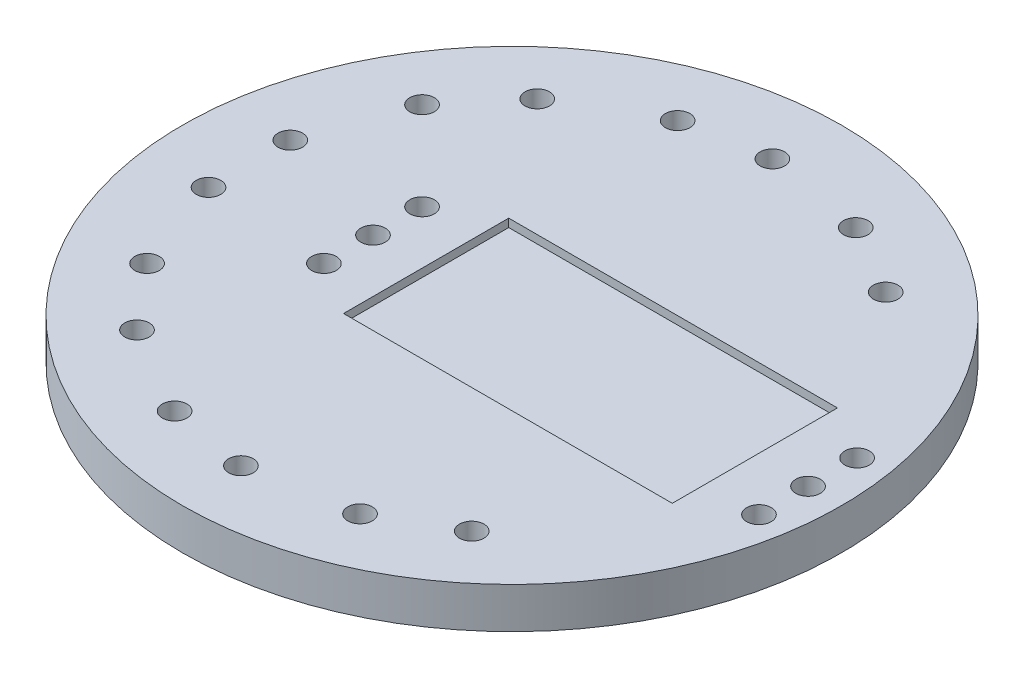
ISO-10303-21;
HEADER;
FILE_DESCRIPTION(('STEP AP214'),'2;1');
FILE_NAME('part.step','',(''),(''),'','','');
FILE_SCHEMA(('AUTOMOTIVE_DESIGN { 1 0 10303 214 1 1 1 1 }'));
ENDSEC;
DATA;
#1=APPLICATION_CONTEXT('core data for automotive mechanical design processes');
#2=APPLICATION_PROTOCOL_DEFINITION('international standard','automotive_design',2000,#1);
#3=PRODUCT_CONTEXT('',#1,'mechanical');
#4=PRODUCT('Part','Part','',(#3));
#5=PRODUCT_RELATED_PRODUCT_CATEGORY('part','',(#4));
#6=PRODUCT_DEFINITION_FORMATION('','',#4);
#7=PRODUCT_DEFINITION_CONTEXT('part definition',#1,'design');
#8=PRODUCT_DEFINITION('design','',#6,#7);
#9=PRODUCT_DEFINITION_SHAPE('','',#8);
#10=(LENGTH_UNIT() NAMED_UNIT(*) SI_UNIT(.MILLI.,.METRE.));
#11=(NAMED_UNIT(*) PLANE_ANGLE_UNIT() SI_UNIT($,.RADIAN.));
#12=(NAMED_UNIT(*) SI_UNIT($,.STERADIAN.) SOLID_ANGLE_UNIT());
#13=UNCERTAINTY_MEASURE_WITH_UNIT(LENGTH_MEASURE(1.E-05),#10,'distance_accuracy_value','');
#14=(GEOMETRIC_REPRESENTATION_CONTEXT(3) GLOBAL_UNCERTAINTY_ASSIGNED_CONTEXT((#13)) GLOBAL_UNIT_ASSIGNED_CONTEXT((#10,
#11,#12)) REPRESENTATION_CONTEXT('',''));
#15=CARTESIAN_POINT('',(0.,0.,0.));
#16=DIRECTION('',(0.,0.,1.));
#17=DIRECTION('',(1.,0.,0.));
#18=AXIS2_PLACEMENT_3D('',#15,#16,#17);
#19=CARTESIAN_POINT('',(0.,5.,0.));
#20=DIRECTION('',(0.,-1.,0.));
#21=DIRECTION('',(0.,0.,-1.));
#22=AXIS2_PLACEMENT_3D('',#19,#20,#21);
#23=CYLINDRICAL_SURFACE('',#22,40.3);
#24=CARTESIAN_POINT('',(0.,5.,0.));
#25=DIRECTION('',(0.,1.,0.));
#26=DIRECTION('',(0.,0.,1.));
#27=AXIS2_PLACEMENT_3D('',#24,#25,#26);
#28=CIRCLE('',#27,40.3);
#29=CARTESIAN_POINT('',(0.,5.,40.3));
#30=VERTEX_POINT('',#29);
#31=EDGE_CURVE('E11',#30,#30,#28,.T.);
#32=ORIENTED_EDGE('',*,*,#31,.F.);
#33=EDGE_LOOP('',(#32));
#34=FACE_BOUND('',#33,.T.);
#35=CARTESIAN_POINT('',(0.,0.,0.));
#36=DIRECTION('',(0.,1.,0.));
#37=DIRECTION('',(0.,0.,1.));
#38=AXIS2_PLACEMENT_3D('',#35,#36,#37);
#39=CIRCLE('',#38,40.3);
#40=CARTESIAN_POINT('',(0.,0.,40.3));
#41=VERTEX_POINT('',#40);
#42=EDGE_CURVE('E42',#41,#41,#39,.T.);
#43=ORIENTED_EDGE('',*,*,#42,.T.);
#44=EDGE_LOOP('',(#43));
#45=FACE_BOUND('',#44,.T.);
#46=ADVANCED_FACE('F39',(#34,#45),#23,.T.);
#47=CARTESIAN_POINT('',(0.,5.,0.));
#48=DIRECTION('',(0.,1.,0.));
#49=DIRECTION('',(0.,0.,1.));
#50=AXIS2_PLACEMENT_3D('',#47,#48,#49);
#51=PLANE('',#50);
#52=CARTESIAN_POINT('',(20.3866677422554,5.,25.3107443266058));
#53=DIRECTION('',(0.,1.,0.));
#54=DIRECTION('',(0.,0.,1.));
#55=AXIS2_PLACEMENT_3D('',#52,#53,#54);
#56=CIRCLE('',#55,1.49999999999932);
#57=CARTESIAN_POINT('',(20.3866677422554,5.,26.8107443266051));
#58=VERTEX_POINT('',#57);
#59=EDGE_CURVE('E312',#58,#58,#56,.T.);
#60=ORIENTED_EDGE('',*,*,#59,.F.);
#61=EDGE_LOOP('',(#60));
#62=FACE_BOUND('',#61,.T.);
#63=CARTESIAN_POINT('',(11.7264137044107,5.,30.3107443266052));
#64=DIRECTION('',(0.,1.,0.));
#65=DIRECTION('',(0.,0.,1.));
#66=AXIS2_PLACEMENT_3D('',#63,#64,#65);
#67=CIRCLE('',#66,1.49999999999862);
#68=CARTESIAN_POINT('',(11.7264137044107,5.,31.8107443266038));
#69=VERTEX_POINT('',#68);
#70=EDGE_CURVE('E306',#69,#69,#67,.T.);
#71=ORIENTED_EDGE('',*,*,#70,.F.);
#72=EDGE_LOOP('',(#71));
#73=FACE_BOUND('',#72,.T.);
#74=CARTESIAN_POINT('',(-0.65233930741957,5.,32.4934524701186));
#75=DIRECTION('',(0.,1.,0.));
#76=DIRECTION('',(0.,0.,1.));
#77=AXIS2_PLACEMENT_3D('',#74,#75,#76);
#78=CIRCLE('',#77,1.49999999999812);
#79=CARTESIAN_POINT('',(-0.65233930741957,5.,33.9934524701167));
#80=VERTEX_POINT('',#79);
#81=EDGE_CURVE('E300',#80,#80,#78,.T.);
#82=ORIENTED_EDGE('',*,*,#81,.F.);
#83=EDGE_LOOP('',(#82));
#84=FACE_BOUND('',#83,.T.);
#85=CARTESIAN_POINT('',(-10.5004168375416,5.,30.7569706934488));
#86=DIRECTION('',(0.,1.,0.));
#87=DIRECTION('',(0.,0.,1.));
#88=AXIS2_PLACEMENT_3D('',#85,#86,#87);
#89=CIRCLE('',#88,1.49999999999766);
#90=CARTESIAN_POINT('',(-10.5004168375416,5.,32.2569706934465));
#91=VERTEX_POINT('',#90);
#92=EDGE_CURVE('E294',#91,#91,#89,.T.);
#93=ORIENTED_EDGE('',*,*,#92,.F.);
#94=EDGE_LOOP('',(#93));
#95=FACE_BOUND('',#94,.T.);
#96=CARTESIAN_POINT('',(-21.3861095452089,5.,24.4721130783636));
#97=DIRECTION('',(0.,1.,0.));
#98=DIRECTION('',(0.,0.,1.));
#99=AXIS2_PLACEMENT_3D('',#96,#97,#98);
#100=CIRCLE('',#99,1.49999999999837);
#101=CARTESIAN_POINT('',(-21.3861095452089,5.,25.9721130783619));
#102=VERTEX_POINT('',#101);
#103=EDGE_CURVE('E261',#102,#102,#100,.T.);
#104=ORIENTED_EDGE('',*,*,#103,.F.);
#105=EDGE_LOOP('',(#104));
#106=FACE_BOUND('',#105,.T.);
#107=CARTESIAN_POINT('',(-0.652339307426327,5.,-32.4934524701265));
#108=DIRECTION('',(0.,1.,0.));
#109=DIRECTION('',(0.,0.,1.));
#110=AXIS2_PLACEMENT_3D('',#107,#108,#109);
#111=CIRCLE('',#110,1.50000000000737);
#112=CARTESIAN_POINT('',(-0.652339307426327,5.,-30.9934524701192));
#113=VERTEX_POINT('',#112);
#114=EDGE_CURVE('E278',#113,#113,#111,.T.);
#115=ORIENTED_EDGE('',*,*,#114,.F.);
#116=EDGE_LOOP('',(#115));
#117=FACE_BOUND('',#116,.T.);
#118=CARTESIAN_POINT('',(-27.8139856420794,5.,-16.8116686471768));
#119=DIRECTION('',(0.,1.,0.));
#120=DIRECTION('',(0.,0.,1.));
#121=AXIS2_PLACEMENT_3D('',#118,#119,#120);
#122=CIRCLE('',#121,1.50000000000406);
#123=CARTESIAN_POINT('',(-27.8139856420794,5.,-15.3116686471728));
#124=VERTEX_POINT('',#123);
#125=EDGE_CURVE('E271',#124,#124,#122,.T.);
#126=ORIENTED_EDGE('',*,*,#125,.F.);
#127=EDGE_LOOP('',(#126));
#128=FACE_BOUND('',#127,.T.);
#129=CARTESIAN_POINT('',(-21.386109545214,5.,-24.4721130783666));
#130=DIRECTION('',(0.,1.,0.));
#131=DIRECTION('',(0.,0.,1.));
#132=AXIS2_PLACEMENT_3D('',#129,#130,#131);
#133=CIRCLE('',#132,1.50000000000402);
#134=CARTESIAN_POINT('',(-21.386109545214,5.,-22.9721130783626));
#135=VERTEX_POINT('',#134);
#136=EDGE_CURVE('E283',#135,#135,#133,.T.);
#137=ORIENTED_EDGE('',*,*,#136,.F.);
#138=EDGE_LOOP('',(#137));
#139=FACE_BOUND('',#138,.T.);
#140=CARTESIAN_POINT('',(-27.8139856420741,5.,16.8116686471736));
#141=DIRECTION('',(0.,1.,0.));
#142=DIRECTION('',(0.,0.,1.));
#143=AXIS2_PLACEMENT_3D('',#140,#141,#142);
#144=CIRCLE('',#143,1.49999999999814);
#145=CARTESIAN_POINT('',(-27.8139856420741,5.,18.3116686471718));
#146=VERTEX_POINT('',#145);
#147=EDGE_CURVE('E253',#146,#146,#144,.T.);
#148=ORIENTED_EDGE('',*,*,#147,.F.);
#149=EDGE_LOOP('',(#148));
#150=FACE_BOUND('',#149,.T.);
#151=CARTESIAN_POINT('',(11.7264137044061,5.,-30.3107443266182));
#152=DIRECTION('',(0.,1.,0.));
#153=DIRECTION('',(0.,0.,1.));
#154=AXIS2_PLACEMENT_3D('',#151,#152,#153);
#155=CIRCLE('',#154,1.50000000000858);
#156=CARTESIAN_POINT('',(11.7264137044061,5.,-28.8107443266097));
#157=VERTEX_POINT('',#156);
#158=EDGE_CURVE('E246',#157,#157,#155,.T.);
#159=ORIENTED_EDGE('',*,*,#158,.F.);
#160=EDGE_LOOP('',(#159));
#161=FACE_BOUND('',#160,.T.);
#162=CARTESIAN_POINT('',(20.3866677422504,5.,-25.3107443266181));
#163=DIRECTION('',(0.,1.,0.));
#164=DIRECTION('',(0.,0.,1.));
#165=AXIS2_PLACEMENT_3D('',#162,#163,#164);
#166=CIRCLE('',#165,1.50000000000845);
#167=CARTESIAN_POINT('',(20.3866677422504,5.,-23.8107443266096));
#168=VERTEX_POINT('',#167);
#169=EDGE_CURVE('E251',#168,#168,#166,.T.);
#170=ORIENTED_EDGE('',*,*,#169,.F.);
#171=EDGE_LOOP('',(#170));
#172=FACE_BOUND('',#171,.T.);
#173=CARTESIAN_POINT('',(-10.5004168375484,5.,-30.7569706934574));
#174=DIRECTION('',(0.,1.,0.));
#175=DIRECTION('',(0.,0.,1.));
#176=AXIS2_PLACEMENT_3D('',#173,#174,#175);
#177=CIRCLE('',#176,1.50000000000745);
#178=CARTESIAN_POINT('',(-10.5004168375484,5.,-29.2569706934499));
#179=VERTEX_POINT('',#178);
#180=EDGE_CURVE('E262',#179,#179,#177,.T.);
#181=ORIENTED_EDGE('',*,*,#180,.F.);
#182=EDGE_LOOP('',(#181));
#183=FACE_BOUND('',#182,.T.);
#184=CARTESIAN_POINT('',(-32.1130814466628,5.,-5.));
#185=DIRECTION('',(0.,1.,0.));
#186=DIRECTION('',(0.,0.,1.));
#187=AXIS2_PLACEMENT_3D('',#184,#185,#186);
#188=CIRCLE('',#187,1.5);
#189=CARTESIAN_POINT('',(-32.1130814466628,5.,-3.5));
#190=VERTEX_POINT('',#189);
#191=EDGE_CURVE('E317',#190,#190,#188,.T.);
#192=ORIENTED_EDGE('',*,*,#191,.F.);
#193=EDGE_LOOP('',(#192));
#194=FACE_BOUND('',#193,.T.);
#195=CARTESIAN_POINT('',(-32.1130814466628,5.,5.));
#196=DIRECTION('',(0.,1.,0.));
#197=DIRECTION('',(0.,0.,1.));
#198=AXIS2_PLACEMENT_3D('',#195,#196,#197);
#199=CIRCLE('',#198,1.5);
#200=CARTESIAN_POINT('',(-32.1130814466628,5.,6.5));
#201=VERTEX_POINT('',#200);
#202=EDGE_CURVE('E321',#201,#201,#199,.T.);
#203=ORIENTED_EDGE('',*,*,#202,.F.);
#204=EDGE_LOOP('',(#203));
#205=FACE_BOUND('',#204,.T.);
#206=CARTESIAN_POINT('',(-17.,5.,0.));
#207=DIRECTION('',(0.,1.,0.));
#208=DIRECTION('',(0.,0.,1.));
#209=AXIS2_PLACEMENT_3D('',#206,#207,#208);
#210=CIRCLE('',#209,1.5);
#211=CARTESIAN_POINT('',(-17.,5.,1.5));
#212=VERTEX_POINT('',#211);
#213=EDGE_CURVE('E335',#212,#212,#210,.T.);
#214=ORIENTED_EDGE('',*,*,#213,.F.);
#215=EDGE_LOOP('',(#214));
#216=FACE_BOUND('',#215,.T.);
#217=CARTESIAN_POINT('',(-17.,5.,-6.));
#218=DIRECTION('',(0.,1.,0.));
#219=DIRECTION('',(0.,0.,1.));
#220=AXIS2_PLACEMENT_3D('',#217,#218,#219);
#221=CIRCLE('',#220,1.5);
#222=CARTESIAN_POINT('',(-17.,5.,-4.5));
#223=VERTEX_POINT('',#222);
#224=EDGE_CURVE('E342',#223,#223,#221,.T.);
#225=ORIENTED_EDGE('',*,*,#224,.F.);
#226=EDGE_LOOP('',(#225));
#227=FACE_BOUND('',#226,.T.);
#228=CARTESIAN_POINT('',(36.2,5.,6.));
#229=DIRECTION('',(0.,1.,0.));
#230=DIRECTION('',(0.,0.,1.));
#231=AXIS2_PLACEMENT_3D('',#228,#229,#230);
#232=CIRCLE('',#231,1.5);
#233=CARTESIAN_POINT('',(36.2,5.,7.5));
#234=VERTEX_POINT('',#233);
#235=EDGE_CURVE('E348',#234,#234,#232,.T.);
#236=ORIENTED_EDGE('',*,*,#235,.F.);
#237=EDGE_LOOP('',(#236));
#238=FACE_BOUND('',#237,.T.);
#239=CARTESIAN_POINT('',(36.2,5.,0.));
#240=DIRECTION('',(0.,1.,0.));
#241=DIRECTION('',(0.,0.,1.));
#242=AXIS2_PLACEMENT_3D('',#239,#240,#241);
#243=CIRCLE('',#242,1.5);
#244=CARTESIAN_POINT('',(36.2,5.,1.5));
#245=VERTEX_POINT('',#244);
#246=EDGE_CURVE('E354',#245,#245,#243,.T.);
#247=ORIENTED_EDGE('',*,*,#246,.F.);
#248=EDGE_LOOP('',(#247));
#249=FACE_BOUND('',#248,.T.);
#250=CARTESIAN_POINT('',(36.2,5.,-6.));
#251=DIRECTION('',(0.,1.,0.));
#252=DIRECTION('',(0.,0.,1.));
#253=AXIS2_PLACEMENT_3D('',#250,#251,#252);
#254=CIRCLE('',#253,1.5);
#255=CARTESIAN_POINT('',(36.2,5.,-4.5));
#256=VERTEX_POINT('',#255);
#257=EDGE_CURVE('E329',#256,#256,#254,.T.);
#258=ORIENTED_EDGE('',*,*,#257,.F.);
#259=EDGE_LOOP('',(#258));
#260=FACE_BOUND('',#259,.T.);
#261=CARTESIAN_POINT('',(-17.,5.,6.));
#262=DIRECTION('',(0.,1.,0.));
#263=DIRECTION('',(0.,0.,1.));
#264=AXIS2_PLACEMENT_3D('',#261,#262,#263);
#265=CIRCLE('',#264,1.5);
#266=CARTESIAN_POINT('',(-17.,5.,7.5));
#267=VERTEX_POINT('',#266);
#268=EDGE_CURVE('E338',#267,#267,#265,.T.);
#269=ORIENTED_EDGE('',*,*,#268,.F.);
#270=EDGE_LOOP('',(#269));
#271=FACE_BOUND('',#270,.T.);
#272=DIRECTION('',(0.,0.,1.));
#273=VECTOR('',#272,1.);
#274=CARTESIAN_POINT('',(-10.5,5.,10.1));
#275=LINE('',#274,#273);
#276=CARTESIAN_POINT('',(-10.5,5.,-10.1));
#277=VERTEX_POINT('',#276);
#278=CARTESIAN_POINT('',(-10.5,5.,10.1));
#279=VERTEX_POINT('',#278);
#280=EDGE_CURVE('E53',#277,#279,#275,.T.);
#281=ORIENTED_EDGE('',*,*,#280,.F.);
#282=DIRECTION('',(-1.,0.,0.));
#283=VECTOR('',#282,1.);
#284=CARTESIAN_POINT('',(29.7,5.,-10.1));
#285=LINE('',#284,#283);
#286=CARTESIAN_POINT('',(29.7,5.,-10.1));
#287=VERTEX_POINT('',#286);
#288=EDGE_CURVE('E104',#287,#277,#285,.T.);
#289=ORIENTED_EDGE('',*,*,#288,.F.);
#290=DIRECTION('',(0.,0.,-1.));
#291=VECTOR('',#290,1.);
#292=CARTESIAN_POINT('',(29.7,5.,10.1));
#293=LINE('',#292,#291);
#294=CARTESIAN_POINT('',(29.7,5.,10.1));
#295=VERTEX_POINT('',#294);
#296=EDGE_CURVE('E112',#295,#287,#293,.T.);
#297=ORIENTED_EDGE('',*,*,#296,.F.);
#298=DIRECTION('',(1.,0.,0.));
#299=VECTOR('',#298,1.);
#300=CARTESIAN_POINT('',(29.7,5.,10.1));
#301=LINE('',#300,#299);
#302=EDGE_CURVE('E88',#279,#295,#301,.T.);
#303=ORIENTED_EDGE('',*,*,#302,.F.);
#304=EDGE_LOOP('',(#281,#289,#297,#303));
#305=FACE_BOUND('',#304,.T.);
#306=ORIENTED_EDGE('',*,*,#31,.T.);
#307=EDGE_LOOP('',(#306));
#308=FACE_BOUND('',#307,.T.);
#309=ADVANCED_FACE('F118',(#62,#73,#84,#95,#106,#117,#128,#139,#150,#161,#172,#183,#194,#205,
#216,#227,#238,#249,#260,#271,#305,#308),#51,.T.);
#310=CARTESIAN_POINT('',(0.,0.,0.));
#311=DIRECTION('',(0.,1.,0.));
#312=DIRECTION('',(0.,0.,1.));
#313=AXIS2_PLACEMENT_3D('',#310,#311,#312);
#314=PLANE('',#313);
#315=CARTESIAN_POINT('',(20.3866677422554,0.,25.3107443266058));
#316=DIRECTION('',(0.,1.,0.));
#317=DIRECTION('',(0.,0.,1.));
#318=AXIS2_PLACEMENT_3D('',#315,#316,#317);
#319=CIRCLE('',#318,1.49999999999932);
#320=CARTESIAN_POINT('',(20.3866677422554,0.,26.8107443266051));
#321=VERTEX_POINT('',#320);
#322=EDGE_CURVE('E315',#321,#321,#319,.T.);
#323=ORIENTED_EDGE('',*,*,#322,.T.);
#324=EDGE_LOOP('',(#323));
#325=FACE_BOUND('',#324,.T.);
#326=CARTESIAN_POINT('',(11.7264137044107,0.,30.3107443266052));
#327=DIRECTION('',(0.,1.,0.));
#328=DIRECTION('',(0.,0.,1.));
#329=AXIS2_PLACEMENT_3D('',#326,#327,#328);
#330=CIRCLE('',#329,1.49999999999862);
#331=CARTESIAN_POINT('',(11.7264137044107,0.,31.8107443266038));
#332=VERTEX_POINT('',#331);
#333=EDGE_CURVE('E309',#332,#332,#330,.T.);
#334=ORIENTED_EDGE('',*,*,#333,.T.);
#335=EDGE_LOOP('',(#334));
#336=FACE_BOUND('',#335,.T.);
#337=CARTESIAN_POINT('',(-0.65233930741957,0.,32.4934524701186));
#338=DIRECTION('',(0.,1.,0.));
#339=DIRECTION('',(0.,0.,1.));
#340=AXIS2_PLACEMENT_3D('',#337,#338,#339);
#341=CIRCLE('',#340,1.49999999999812);
#342=CARTESIAN_POINT('',(-0.65233930741957,0.,33.9934524701167));
#343=VERTEX_POINT('',#342);
#344=EDGE_CURVE('E303',#343,#343,#341,.T.);
#345=ORIENTED_EDGE('',*,*,#344,.T.);
#346=EDGE_LOOP('',(#345));
#347=FACE_BOUND('',#346,.T.);
#348=CARTESIAN_POINT('',(-10.5004168375416,0.,30.7569706934488));
#349=DIRECTION('',(0.,1.,0.));
#350=DIRECTION('',(0.,0.,1.));
#351=AXIS2_PLACEMENT_3D('',#348,#349,#350);
#352=CIRCLE('',#351,1.49999999999766);
#353=CARTESIAN_POINT('',(-10.5004168375416,0.,32.2569706934465));
#354=VERTEX_POINT('',#353);
#355=EDGE_CURVE('E297',#354,#354,#352,.T.);
#356=ORIENTED_EDGE('',*,*,#355,.T.);
#357=EDGE_LOOP('',(#356));
#358=FACE_BOUND('',#357,.T.);
#359=CARTESIAN_POINT('',(-21.3861095452089,0.,24.4721130783636));
#360=DIRECTION('',(0.,1.,0.));
#361=DIRECTION('',(0.,0.,1.));
#362=AXIS2_PLACEMENT_3D('',#359,#360,#361);
#363=CIRCLE('',#362,1.49999999999837);
#364=CARTESIAN_POINT('',(-21.3861095452089,0.,25.9721130783619));
#365=VERTEX_POINT('',#364);
#366=EDGE_CURVE('E291',#365,#365,#363,.T.);
#367=ORIENTED_EDGE('',*,*,#366,.T.);
#368=EDGE_LOOP('',(#367));
#369=FACE_BOUND('',#368,.T.);
#370=CARTESIAN_POINT('',(-0.652339307426327,0.,-32.4934524701265));
#371=DIRECTION('',(0.,1.,0.));
#372=DIRECTION('',(0.,0.,1.));
#373=AXIS2_PLACEMENT_3D('',#370,#371,#372);
#374=CIRCLE('',#373,1.50000000000737);
#375=CARTESIAN_POINT('',(-0.652339307426327,0.,-30.9934524701192));
#376=VERTEX_POINT('',#375);
#377=EDGE_CURVE('E265',#376,#376,#374,.T.);
#378=ORIENTED_EDGE('',*,*,#377,.T.);
#379=EDGE_LOOP('',(#378));
#380=FACE_BOUND('',#379,.T.);
#381=CARTESIAN_POINT('',(-27.8139856420794,0.,-16.8116686471768));
#382=DIRECTION('',(0.,1.,0.));
#383=DIRECTION('',(0.,0.,1.));
#384=AXIS2_PLACEMENT_3D('',#381,#382,#383);
#385=CIRCLE('',#384,1.50000000000406);
#386=CARTESIAN_POINT('',(-27.8139856420794,0.,-15.3116686471728));
#387=VERTEX_POINT('',#386);
#388=EDGE_CURVE('E275',#387,#387,#385,.T.);
#389=ORIENTED_EDGE('',*,*,#388,.T.);
#390=EDGE_LOOP('',(#389));
#391=FACE_BOUND('',#390,.T.);
#392=CARTESIAN_POINT('',(-21.386109545214,0.,-24.4721130783666));
#393=DIRECTION('',(0.,1.,0.));
#394=DIRECTION('',(0.,0.,1.));
#395=AXIS2_PLACEMENT_3D('',#392,#393,#394);
#396=CIRCLE('',#395,1.50000000000402);
#397=CARTESIAN_POINT('',(-21.386109545214,0.,-22.9721130783626));
#398=VERTEX_POINT('',#397);
#399=EDGE_CURVE('E274',#398,#398,#396,.T.);
#400=ORIENTED_EDGE('',*,*,#399,.T.);
#401=EDGE_LOOP('',(#400));
#402=FACE_BOUND('',#401,.T.);
#403=CARTESIAN_POINT('',(-27.8139856420741,0.,16.8116686471736));
#404=DIRECTION('',(0.,1.,0.));
#405=DIRECTION('',(0.,0.,1.));
#406=AXIS2_PLACEMENT_3D('',#403,#404,#405);
#407=CIRCLE('',#406,1.49999999999814);
#408=CARTESIAN_POINT('',(-27.8139856420741,0.,18.3116686471718));
#409=VERTEX_POINT('',#408);
#410=EDGE_CURVE('E258',#409,#409,#407,.T.);
#411=ORIENTED_EDGE('',*,*,#410,.T.);
#412=EDGE_LOOP('',(#411));
#413=FACE_BOUND('',#412,.T.);
#414=CARTESIAN_POINT('',(11.7264137044061,0.,-30.3107443266182));
#415=DIRECTION('',(0.,1.,0.));
#416=DIRECTION('',(0.,0.,1.));
#417=AXIS2_PLACEMENT_3D('',#414,#415,#416);
#418=CIRCLE('',#417,1.50000000000858);
#419=CARTESIAN_POINT('',(11.7264137044061,0.,-28.8107443266097));
#420=VERTEX_POINT('',#419);
#421=EDGE_CURVE('E243',#420,#420,#418,.T.);
#422=ORIENTED_EDGE('',*,*,#421,.T.);
#423=EDGE_LOOP('',(#422));
#424=FACE_BOUND('',#423,.T.);
#425=CARTESIAN_POINT('',(20.3866677422504,0.,-25.3107443266181));
#426=DIRECTION('',(0.,1.,0.));
#427=DIRECTION('',(0.,0.,1.));
#428=AXIS2_PLACEMENT_3D('',#425,#426,#427);
#429=CIRCLE('',#428,1.50000000000845);
#430=CARTESIAN_POINT('',(20.3866677422504,0.,-23.8107443266096));
#431=VERTEX_POINT('',#430);
#432=EDGE_CURVE('E248',#431,#431,#429,.T.);
#433=ORIENTED_EDGE('',*,*,#432,.T.);
#434=EDGE_LOOP('',(#433));
#435=FACE_BOUND('',#434,.T.);
#436=CARTESIAN_POINT('',(-10.5004168375484,0.,-30.7569706934574));
#437=DIRECTION('',(0.,1.,0.));
#438=DIRECTION('',(0.,0.,1.));
#439=AXIS2_PLACEMENT_3D('',#436,#437,#438);
#440=CIRCLE('',#439,1.50000000000745);
#441=CARTESIAN_POINT('',(-10.5004168375484,0.,-29.2569706934499));
#442=VERTEX_POINT('',#441);
#443=EDGE_CURVE('E266',#442,#442,#440,.T.);
#444=ORIENTED_EDGE('',*,*,#443,.T.);
#445=EDGE_LOOP('',(#444));
#446=FACE_BOUND('',#445,.T.);
#447=CARTESIAN_POINT('',(-32.1130814466628,0.,-5.));
#448=DIRECTION('',(0.,1.,0.));
#449=DIRECTION('',(0.,0.,1.));
#450=AXIS2_PLACEMENT_3D('',#447,#448,#449);
#451=CIRCLE('',#450,1.5);
#452=CARTESIAN_POINT('',(-32.1130814466628,0.,-3.5));
#453=VERTEX_POINT('',#452);
#454=EDGE_CURVE('E320',#453,#453,#451,.F.);
#455=ORIENTED_EDGE('',*,*,#454,.F.);
#456=EDGE_LOOP('',(#455));
#457=FACE_BOUND('',#456,.T.);
#458=CARTESIAN_POINT('',(-32.1130814466628,0.,5.));
#459=DIRECTION('',(0.,1.,0.));
#460=DIRECTION('',(0.,0.,1.));
#461=AXIS2_PLACEMENT_3D('',#458,#459,#460);
#462=CIRCLE('',#461,1.5);
#463=CARTESIAN_POINT('',(-32.1130814466628,0.,6.5));
#464=VERTEX_POINT('',#463);
#465=EDGE_CURVE('E286',#464,#464,#462,.F.);
#466=ORIENTED_EDGE('',*,*,#465,.F.);
#467=EDGE_LOOP('',(#466));
#468=FACE_BOUND('',#467,.T.);
#469=CARTESIAN_POINT('',(-17.,0.,0.));
#470=DIRECTION('',(0.,1.,0.));
#471=DIRECTION('',(0.,0.,1.));
#472=AXIS2_PLACEMENT_3D('',#469,#470,#471);
#473=CIRCLE('',#472,1.5);
#474=CARTESIAN_POINT('',(-17.,0.,1.5));
#475=VERTEX_POINT('',#474);
#476=EDGE_CURVE('E339',#475,#475,#473,.T.);
#477=ORIENTED_EDGE('',*,*,#476,.T.);
#478=EDGE_LOOP('',(#477));
#479=FACE_BOUND('',#478,.T.);
#480=CARTESIAN_POINT('',(-17.,0.,-6.));
#481=DIRECTION('',(0.,1.,0.));
#482=DIRECTION('',(0.,0.,1.));
#483=AXIS2_PLACEMENT_3D('',#480,#481,#482);
#484=CIRCLE('',#483,1.5);
#485=CARTESIAN_POINT('',(-17.,0.,-4.5));
#486=VERTEX_POINT('',#485);
#487=EDGE_CURVE('E345',#486,#486,#484,.T.);
#488=ORIENTED_EDGE('',*,*,#487,.T.);
#489=EDGE_LOOP('',(#488));
#490=FACE_BOUND('',#489,.T.);
#491=CARTESIAN_POINT('',(36.2,0.,6.));
#492=DIRECTION('',(0.,1.,0.));
#493=DIRECTION('',(0.,0.,1.));
#494=AXIS2_PLACEMENT_3D('',#491,#492,#493);
#495=CIRCLE('',#494,1.5);
#496=CARTESIAN_POINT('',(36.2,0.,7.5));
#497=VERTEX_POINT('',#496);
#498=EDGE_CURVE('E351',#497,#497,#495,.T.);
#499=ORIENTED_EDGE('',*,*,#498,.T.);
#500=EDGE_LOOP('',(#499));
#501=FACE_BOUND('',#500,.T.);
#502=CARTESIAN_POINT('',(36.2,0.,0.));
#503=DIRECTION('',(0.,1.,0.));
#504=DIRECTION('',(0.,0.,1.));
#505=AXIS2_PLACEMENT_3D('',#502,#503,#504);
#506=CIRCLE('',#505,1.5);
#507=CARTESIAN_POINT('',(36.2,0.,1.5));
#508=VERTEX_POINT('',#507);
#509=EDGE_CURVE('E332',#508,#508,#506,.T.);
#510=ORIENTED_EDGE('',*,*,#509,.T.);
#511=EDGE_LOOP('',(#510));
#512=FACE_BOUND('',#511,.T.);
#513=CARTESIAN_POINT('',(36.2,0.,-6.));
#514=DIRECTION('',(0.,1.,0.));
#515=DIRECTION('',(0.,0.,1.));
#516=AXIS2_PLACEMENT_3D('',#513,#514,#515);
#517=CIRCLE('',#516,1.5);
#518=CARTESIAN_POINT('',(36.2,0.,-4.5));
#519=VERTEX_POINT('',#518);
#520=EDGE_CURVE('E324',#519,#519,#517,.T.);
#521=ORIENTED_EDGE('',*,*,#520,.T.);
#522=EDGE_LOOP('',(#521));
#523=FACE_BOUND('',#522,.T.);
#524=CARTESIAN_POINT('',(-17.,0.,6.));
#525=DIRECTION('',(0.,1.,0.));
#526=DIRECTION('',(0.,0.,1.));
#527=AXIS2_PLACEMENT_3D('',#524,#525,#526);
#528=CIRCLE('',#527,1.5);
#529=CARTESIAN_POINT('',(-17.,0.,7.5));
#530=VERTEX_POINT('',#529);
#531=EDGE_CURVE('E110',#530,#530,#528,.T.);
#532=ORIENTED_EDGE('',*,*,#531,.T.);
#533=EDGE_LOOP('',(#532));
#534=FACE_BOUND('',#533,.T.);
#535=ORIENTED_EDGE('',*,*,#42,.F.);
#536=EDGE_LOOP('',(#535));
#537=FACE_BOUND('',#536,.T.);
#538=ADVANCED_FACE('F130',(#325,#336,#347,#358,#369,#380,#391,#402,#413,#424,#435,#446,#457,
#468,#479,#490,#501,#512,#523,#534,#537),#314,.F.);
#539=CARTESIAN_POINT('',(-10.5,4.,10.1));
#540=DIRECTION('',(-1.,0.,0.));
#541=DIRECTION('',(0.,0.,1.));
#542=AXIS2_PLACEMENT_3D('',#539,#540,#541);
#543=PLANE('',#542);
#544=ORIENTED_EDGE('',*,*,#280,.T.);
#545=DIRECTION('',(0.,1.,0.));
#546=VECTOR('',#545,1.);
#547=CARTESIAN_POINT('',(-10.5,4.,10.1));
#548=LINE('',#547,#546);
#549=CARTESIAN_POINT('',(-10.5,4.,10.1));
#550=VERTEX_POINT('',#549);
#551=EDGE_CURVE('E76',#550,#279,#548,.T.);
#552=ORIENTED_EDGE('',*,*,#551,.F.);
#553=DIRECTION('',(0.,0.,1.));
#554=VECTOR('',#553,1.);
#555=CARTESIAN_POINT('',(-10.5,4.,10.1));
#556=LINE('',#555,#554);
#557=CARTESIAN_POINT('',(-10.5,4.,-10.1));
#558=VERTEX_POINT('',#557);
#559=EDGE_CURVE('E102',#558,#550,#556,.T.);
#560=ORIENTED_EDGE('',*,*,#559,.F.);
#561=DIRECTION('',(0.,1.,0.));
#562=VECTOR('',#561,1.);
#563=CARTESIAN_POINT('',(-10.5,4.,-10.1));
#564=LINE('',#563,#562);
#565=EDGE_CURVE('E61',#558,#277,#564,.T.);
#566=ORIENTED_EDGE('',*,*,#565,.T.);
#567=EDGE_LOOP('',(#544,#552,#560,#566));
#568=FACE_BOUND('',#567,.T.);
#569=ADVANCED_FACE('F123',(#568),#543,.F.);
#570=CARTESIAN_POINT('',(29.7,4.,-10.1));
#571=DIRECTION('',(0.,0.,-1.));
#572=DIRECTION('',(-1.,0.,0.));
#573=AXIS2_PLACEMENT_3D('',#570,#571,#572);
#574=PLANE('',#573);
#575=ORIENTED_EDGE('',*,*,#288,.T.);
#576=ORIENTED_EDGE('',*,*,#565,.F.);
#577=DIRECTION('',(-1.,0.,0.));
#578=VECTOR('',#577,1.);
#579=CARTESIAN_POINT('',(29.7,4.,-10.1));
#580=LINE('',#579,#578);
#581=CARTESIAN_POINT('',(29.7,4.,-10.1));
#582=VERTEX_POINT('',#581);
#583=EDGE_CURVE('E99',#582,#558,#580,.T.);
#584=ORIENTED_EDGE('',*,*,#583,.F.);
#585=DIRECTION('',(0.,1.,0.));
#586=VECTOR('',#585,1.);
#587=CARTESIAN_POINT('',(29.7,4.,-10.1));
#588=LINE('',#587,#586);
#589=EDGE_CURVE('E92',#582,#287,#588,.T.);
#590=ORIENTED_EDGE('',*,*,#589,.T.);
#591=EDGE_LOOP('',(#575,#576,#584,#590));
#592=FACE_BOUND('',#591,.T.);
#593=ADVANCED_FACE('F121',(#592),#574,.F.);
#594=CARTESIAN_POINT('',(29.7,4.,10.1));
#595=DIRECTION('',(1.,0.,0.));
#596=DIRECTION('',(0.,0.,-1.));
#597=AXIS2_PLACEMENT_3D('',#594,#595,#596);
#598=PLANE('',#597);
#599=ORIENTED_EDGE('',*,*,#296,.T.);
#600=ORIENTED_EDGE('',*,*,#589,.F.);
#601=DIRECTION('',(0.,0.,-1.));
#602=VECTOR('',#601,1.);
#603=CARTESIAN_POINT('',(29.7,4.,10.1));
#604=LINE('',#603,#602);
#605=CARTESIAN_POINT('',(29.7,4.,10.1));
#606=VERTEX_POINT('',#605);
#607=EDGE_CURVE('E95',#606,#582,#604,.T.);
#608=ORIENTED_EDGE('',*,*,#607,.F.);
#609=DIRECTION('',(0.,1.,0.));
#610=VECTOR('',#609,1.);
#611=CARTESIAN_POINT('',(29.7,4.,10.1));
#612=LINE('',#611,#610);
#613=EDGE_CURVE('E81',#606,#295,#612,.T.);
#614=ORIENTED_EDGE('',*,*,#613,.T.);
#615=EDGE_LOOP('',(#599,#600,#608,#614));
#616=FACE_BOUND('',#615,.T.);
#617=ADVANCED_FACE('F96',(#616),#598,.F.);
#618=CARTESIAN_POINT('',(29.7,4.,10.1));
#619=DIRECTION('',(0.,0.,1.));
#620=DIRECTION('',(1.,0.,0.));
#621=AXIS2_PLACEMENT_3D('',#618,#619,#620);
#622=PLANE('',#621);
#623=ORIENTED_EDGE('',*,*,#302,.T.);
#624=ORIENTED_EDGE('',*,*,#613,.F.);
#625=DIRECTION('',(1.,0.,0.));
#626=VECTOR('',#625,1.);
#627=CARTESIAN_POINT('',(29.7,4.,10.1));
#628=LINE('',#627,#626);
#629=EDGE_CURVE('E85',#550,#606,#628,.T.);
#630=ORIENTED_EDGE('',*,*,#629,.F.);
#631=ORIENTED_EDGE('',*,*,#551,.T.);
#632=EDGE_LOOP('',(#623,#624,#630,#631));
#633=FACE_BOUND('',#632,.T.);
#634=ADVANCED_FACE('F83',(#633),#622,.F.);
#635=CARTESIAN_POINT('',(0.,4.,0.));
#636=DIRECTION('',(0.,1.,0.));
#637=DIRECTION('',(0.,0.,1.));
#638=AXIS2_PLACEMENT_3D('',#635,#636,#637);
#639=PLANE('',#638);
#640=ORIENTED_EDGE('',*,*,#559,.T.);
#641=ORIENTED_EDGE('',*,*,#629,.T.);
#642=ORIENTED_EDGE('',*,*,#607,.T.);
#643=ORIENTED_EDGE('',*,*,#583,.T.);
#644=EDGE_LOOP('',(#640,#641,#642,#643));
#645=FACE_BOUND('',#644,.T.);
#646=ADVANCED_FACE('F101',(#645),#639,.T.);
#647=CARTESIAN_POINT('',(-17.,0.,6.));
#648=DIRECTION('',(0.,1.,0.));
#649=DIRECTION('',(0.,0.,1.));
#650=AXIS2_PLACEMENT_3D('',#647,#648,#649);
#651=CYLINDRICAL_SURFACE('',#650,1.5);
#652=ORIENTED_EDGE('',*,*,#531,.F.);
#653=EDGE_LOOP('',(#652));
#654=FACE_BOUND('',#653,.T.);
#655=ORIENTED_EDGE('',*,*,#268,.T.);
#656=EDGE_LOOP('',(#655));
#657=FACE_BOUND('',#656,.T.);
#658=ADVANCED_FACE('F157',(#654,#657),#651,.F.);
#659=CARTESIAN_POINT('',(36.2,0.,-6.));
#660=DIRECTION('',(0.,1.,0.));
#661=DIRECTION('',(0.,0.,1.));
#662=AXIS2_PLACEMENT_3D('',#659,#660,#661);
#663=CYLINDRICAL_SURFACE('',#662,1.5);
#664=ORIENTED_EDGE('',*,*,#520,.F.);
#665=EDGE_LOOP('',(#664));
#666=FACE_BOUND('',#665,.T.);
#667=ORIENTED_EDGE('',*,*,#257,.T.);
#668=EDGE_LOOP('',(#667));
#669=FACE_BOUND('',#668,.T.);
#670=ADVANCED_FACE('F161',(#666,#669),#663,.F.);
#671=CARTESIAN_POINT('',(36.2,0.,0.));
#672=DIRECTION('',(0.,1.,0.));
#673=DIRECTION('',(0.,0.,1.));
#674=AXIS2_PLACEMENT_3D('',#671,#672,#673);
#675=CYLINDRICAL_SURFACE('',#674,1.5);
#676=ORIENTED_EDGE('',*,*,#509,.F.);
#677=EDGE_LOOP('',(#676));
#678=FACE_BOUND('',#677,.T.);
#679=ORIENTED_EDGE('',*,*,#246,.T.);
#680=EDGE_LOOP('',(#679));
#681=FACE_BOUND('',#680,.T.);
#682=ADVANCED_FACE('F165',(#678,#681),#675,.F.);
#683=CARTESIAN_POINT('',(36.2,0.,6.));
#684=DIRECTION('',(0.,1.,0.));
#685=DIRECTION('',(0.,0.,1.));
#686=AXIS2_PLACEMENT_3D('',#683,#684,#685);
#687=CYLINDRICAL_SURFACE('',#686,1.5);
#688=ORIENTED_EDGE('',*,*,#498,.F.);
#689=EDGE_LOOP('',(#688));
#690=FACE_BOUND('',#689,.T.);
#691=ORIENTED_EDGE('',*,*,#235,.T.);
#692=EDGE_LOOP('',(#691));
#693=FACE_BOUND('',#692,.T.);
#694=ADVANCED_FACE('F168',(#690,#693),#687,.F.);
#695=CARTESIAN_POINT('',(-17.,0.,-6.));
#696=DIRECTION('',(0.,1.,0.));
#697=DIRECTION('',(0.,0.,1.));
#698=AXIS2_PLACEMENT_3D('',#695,#696,#697);
#699=CYLINDRICAL_SURFACE('',#698,1.5);
#700=ORIENTED_EDGE('',*,*,#487,.F.);
#701=EDGE_LOOP('',(#700));
#702=FACE_BOUND('',#701,.T.);
#703=ORIENTED_EDGE('',*,*,#224,.T.);
#704=EDGE_LOOP('',(#703));
#705=FACE_BOUND('',#704,.T.);
#706=ADVANCED_FACE('F172',(#702,#705),#699,.F.);
#707=CARTESIAN_POINT('',(-17.,0.,0.));
#708=DIRECTION('',(0.,1.,0.));
#709=DIRECTION('',(0.,0.,1.));
#710=AXIS2_PLACEMENT_3D('',#707,#708,#709);
#711=CYLINDRICAL_SURFACE('',#710,1.5);
#712=ORIENTED_EDGE('',*,*,#476,.F.);
#713=EDGE_LOOP('',(#712));
#714=FACE_BOUND('',#713,.T.);
#715=ORIENTED_EDGE('',*,*,#213,.T.);
#716=EDGE_LOOP('',(#715));
#717=FACE_BOUND('',#716,.T.);
#718=ADVANCED_FACE('F176',(#714,#717),#711,.F.);
#719=CARTESIAN_POINT('',(-32.1130814466628,-0.00100000000000013,5.));
#720=DIRECTION('',(0.,1.,0.));
#721=DIRECTION('',(0.,0.,1.));
#722=AXIS2_PLACEMENT_3D('',#719,#720,#721);
#723=CYLINDRICAL_SURFACE('',#722,1.5);
#724=ORIENTED_EDGE('',*,*,#202,.T.);
#725=EDGE_LOOP('',(#724));
#726=FACE_BOUND('',#725,.T.);
#727=ORIENTED_EDGE('',*,*,#465,.T.);
#728=EDGE_LOOP('',(#727));
#729=FACE_BOUND('',#728,.T.);
#730=ADVANCED_FACE('F180',(#726,#729),#723,.F.);
#731=CARTESIAN_POINT('',(-32.1130814466628,-0.00100000000000013,-5.));
#732=DIRECTION('',(0.,1.,0.));
#733=DIRECTION('',(0.,0.,1.));
#734=AXIS2_PLACEMENT_3D('',#731,#732,#733);
#735=CYLINDRICAL_SURFACE('',#734,1.5);
#736=ORIENTED_EDGE('',*,*,#191,.T.);
#737=EDGE_LOOP('',(#736));
#738=FACE_BOUND('',#737,.T.);
#739=ORIENTED_EDGE('',*,*,#454,.T.);
#740=EDGE_LOOP('',(#739));
#741=FACE_BOUND('',#740,.T.);
#742=ADVANCED_FACE('F187',(#738,#741),#735,.F.);
#743=CARTESIAN_POINT('',(-10.5004168375484,0.,-30.7569706934574));
#744=DIRECTION('',(0.,1.,0.));
#745=DIRECTION('',(0.,0.,1.));
#746=AXIS2_PLACEMENT_3D('',#743,#744,#745);
#747=CYLINDRICAL_SURFACE('',#746,1.50000000000745);
#748=ORIENTED_EDGE('',*,*,#443,.F.);
#749=EDGE_LOOP('',(#748));
#750=FACE_BOUND('',#749,.T.);
#751=ORIENTED_EDGE('',*,*,#180,.T.);
#752=EDGE_LOOP('',(#751));
#753=FACE_BOUND('',#752,.T.);
#754=ADVANCED_FACE('F191',(#750,#753),#747,.F.);
#755=CARTESIAN_POINT('',(20.3866677422504,0.,-25.3107443266181));
#756=DIRECTION('',(0.,1.,0.));
#757=DIRECTION('',(0.,0.,1.));
#758=AXIS2_PLACEMENT_3D('',#755,#756,#757);
#759=CYLINDRICAL_SURFACE('',#758,1.50000000000845);
#760=ORIENTED_EDGE('',*,*,#432,.F.);
#761=EDGE_LOOP('',(#760));
#762=FACE_BOUND('',#761,.T.);
#763=ORIENTED_EDGE('',*,*,#169,.T.);
#764=EDGE_LOOP('',(#763));
#765=FACE_BOUND('',#764,.T.);
#766=ADVANCED_FACE('F226',(#762,#765),#759,.F.);
#767=CARTESIAN_POINT('',(11.7264137044061,0.,-30.3107443266182));
#768=DIRECTION('',(0.,1.,0.));
#769=DIRECTION('',(0.,0.,1.));
#770=AXIS2_PLACEMENT_3D('',#767,#768,#769);
#771=CYLINDRICAL_SURFACE('',#770,1.50000000000858);
#772=ORIENTED_EDGE('',*,*,#421,.F.);
#773=EDGE_LOOP('',(#772));
#774=FACE_BOUND('',#773,.T.);
#775=ORIENTED_EDGE('',*,*,#158,.T.);
#776=EDGE_LOOP('',(#775));
#777=FACE_BOUND('',#776,.T.);
#778=ADVANCED_FACE('F229',(#774,#777),#771,.F.);
#779=CARTESIAN_POINT('',(-27.8139856420741,0.,16.8116686471736));
#780=DIRECTION('',(0.,1.,0.));
#781=DIRECTION('',(0.,0.,1.));
#782=AXIS2_PLACEMENT_3D('',#779,#780,#781);
#783=CYLINDRICAL_SURFACE('',#782,1.49999999999814);
#784=ORIENTED_EDGE('',*,*,#410,.F.);
#785=EDGE_LOOP('',(#784));
#786=FACE_BOUND('',#785,.T.);
#787=ORIENTED_EDGE('',*,*,#147,.T.);
#788=EDGE_LOOP('',(#787));
#789=FACE_BOUND('',#788,.T.);
#790=ADVANCED_FACE('F218',(#786,#789),#783,.F.);
#791=CARTESIAN_POINT('',(-21.386109545214,0.,-24.4721130783666));
#792=DIRECTION('',(0.,1.,0.));
#793=DIRECTION('',(0.,0.,1.));
#794=AXIS2_PLACEMENT_3D('',#791,#792,#793);
#795=CYLINDRICAL_SURFACE('',#794,1.50000000000402);
#796=ORIENTED_EDGE('',*,*,#399,.F.);
#797=EDGE_LOOP('',(#796));
#798=FACE_BOUND('',#797,.T.);
#799=ORIENTED_EDGE('',*,*,#136,.T.);
#800=EDGE_LOOP('',(#799));
#801=FACE_BOUND('',#800,.T.);
#802=ADVANCED_FACE('F214',(#798,#801),#795,.F.);
#803=CARTESIAN_POINT('',(-27.8139856420794,0.,-16.8116686471768));
#804=DIRECTION('',(0.,1.,0.));
#805=DIRECTION('',(0.,0.,1.));
#806=AXIS2_PLACEMENT_3D('',#803,#804,#805);
#807=CYLINDRICAL_SURFACE('',#806,1.50000000000406);
#808=ORIENTED_EDGE('',*,*,#388,.F.);
#809=EDGE_LOOP('',(#808));
#810=FACE_BOUND('',#809,.T.);
#811=ORIENTED_EDGE('',*,*,#125,.T.);
#812=EDGE_LOOP('',(#811));
#813=FACE_BOUND('',#812,.T.);
#814=ADVANCED_FACE('F217',(#810,#813),#807,.F.);
#815=CARTESIAN_POINT('',(-0.652339307426327,0.,-32.4934524701265));
#816=DIRECTION('',(0.,1.,0.));
#817=DIRECTION('',(0.,0.,1.));
#818=AXIS2_PLACEMENT_3D('',#815,#816,#817);
#819=CYLINDRICAL_SURFACE('',#818,1.50000000000737);
#820=ORIENTED_EDGE('',*,*,#377,.F.);
#821=EDGE_LOOP('',(#820));
#822=FACE_BOUND('',#821,.T.);
#823=ORIENTED_EDGE('',*,*,#114,.T.);
#824=EDGE_LOOP('',(#823));
#825=FACE_BOUND('',#824,.T.);
#826=ADVANCED_FACE('F212',(#822,#825),#819,.F.);
#827=CARTESIAN_POINT('',(-21.3861095452089,0.,24.4721130783636));
#828=DIRECTION('',(0.,1.,0.));
#829=DIRECTION('',(0.,0.,1.));
#830=AXIS2_PLACEMENT_3D('',#827,#828,#829);
#831=CYLINDRICAL_SURFACE('',#830,1.49999999999837);
#832=ORIENTED_EDGE('',*,*,#366,.F.);
#833=EDGE_LOOP('',(#832));
#834=FACE_BOUND('',#833,.T.);
#835=ORIENTED_EDGE('',*,*,#103,.T.);
#836=EDGE_LOOP('',(#835));
#837=FACE_BOUND('',#836,.T.);
#838=ADVANCED_FACE('F208',(#834,#837),#831,.F.);
#839=CARTESIAN_POINT('',(-10.5004168375416,0.,30.7569706934488));
#840=DIRECTION('',(0.,1.,0.));
#841=DIRECTION('',(0.,0.,1.));
#842=AXIS2_PLACEMENT_3D('',#839,#840,#841);
#843=CYLINDRICAL_SURFACE('',#842,1.49999999999766);
#844=ORIENTED_EDGE('',*,*,#355,.F.);
#845=EDGE_LOOP('',(#844));
#846=FACE_BOUND('',#845,.T.);
#847=ORIENTED_EDGE('',*,*,#92,.T.);
#848=EDGE_LOOP('',(#847));
#849=FACE_BOUND('',#848,.T.);
#850=ADVANCED_FACE('F204',(#846,#849),#843,.F.);
#851=CARTESIAN_POINT('',(-0.65233930741957,0.,32.4934524701186));
#852=DIRECTION('',(0.,1.,0.));
#853=DIRECTION('',(0.,0.,1.));
#854=AXIS2_PLACEMENT_3D('',#851,#852,#853);
#855=CYLINDRICAL_SURFACE('',#854,1.49999999999812);
#856=ORIENTED_EDGE('',*,*,#344,.F.);
#857=EDGE_LOOP('',(#856));
#858=FACE_BOUND('',#857,.T.);
#859=ORIENTED_EDGE('',*,*,#81,.T.);
#860=EDGE_LOOP('',(#859));
#861=FACE_BOUND('',#860,.T.);
#862=ADVANCED_FACE('F200',(#858,#861),#855,.F.);
#863=CARTESIAN_POINT('',(11.7264137044107,0.,30.3107443266052));
#864=DIRECTION('',(0.,1.,0.));
#865=DIRECTION('',(0.,0.,1.));
#866=AXIS2_PLACEMENT_3D('',#863,#864,#865);
#867=CYLINDRICAL_SURFACE('',#866,1.49999999999862);
#868=ORIENTED_EDGE('',*,*,#333,.F.);
#869=EDGE_LOOP('',(#868));
#870=FACE_BOUND('',#869,.T.);
#871=ORIENTED_EDGE('',*,*,#70,.T.);
#872=EDGE_LOOP('',(#871));
#873=FACE_BOUND('',#872,.T.);
#874=ADVANCED_FACE('F196',(#870,#873),#867,.F.);
#875=CARTESIAN_POINT('',(20.3866677422554,0.,25.3107443266058));
#876=DIRECTION('',(0.,1.,0.));
#877=DIRECTION('',(0.,0.,1.));
#878=AXIS2_PLACEMENT_3D('',#875,#876,#877);
#879=CYLINDRICAL_SURFACE('',#878,1.49999999999932);
#880=ORIENTED_EDGE('',*,*,#322,.F.);
#881=EDGE_LOOP('',(#880));
#882=FACE_BOUND('',#881,.T.);
#883=ORIENTED_EDGE('',*,*,#59,.T.);
#884=EDGE_LOOP('',(#883));
#885=FACE_BOUND('',#884,.T.);
#886=ADVANCED_FACE('F193',(#882,#885),#879,.F.);
#887=CLOSED_SHELL('',(#46,#309,#538,#569,#593,#617,#634,#646,#658,#670,#682,#694,#706,#718,#730,
#742,#754,#766,#778,#790,#802,#814,#826,#838,#850,#862,#874,#886));
#888=MANIFOLD_SOLID_BREP('B2',#887);
#889=ADVANCED_BREP_SHAPE_REPRESENTATION('',(#18,#888),#14);
#890=SHAPE_DEFINITION_REPRESENTATION(#9,#889);
ENDSEC;
END-ISO-10303-21;
